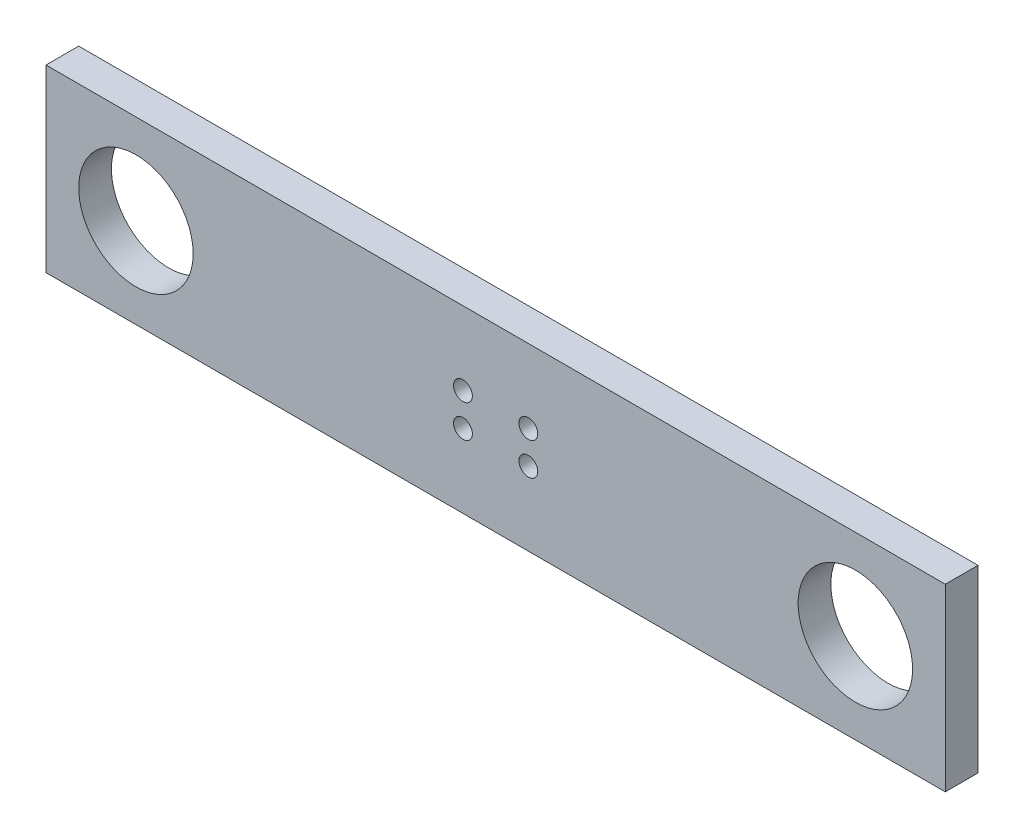
ISO-10303-21;
HEADER;
FILE_DESCRIPTION(('STEP AP214'),'2;1');
FILE_NAME('part.step','',(''),(''),'','','');
FILE_SCHEMA(('AUTOMOTIVE_DESIGN { 1 0 10303 214 1 1 1 1 }'));
ENDSEC;
DATA;
#1=APPLICATION_CONTEXT('core data for automotive mechanical design processes');
#2=APPLICATION_PROTOCOL_DEFINITION('international standard','automotive_design',2000,#1);
#3=PRODUCT_CONTEXT('',#1,'mechanical');
#4=PRODUCT('Part','Part','',(#3));
#5=PRODUCT_RELATED_PRODUCT_CATEGORY('part','',(#4));
#6=PRODUCT_DEFINITION_FORMATION('','',#4);
#7=PRODUCT_DEFINITION_CONTEXT('part definition',#1,'design');
#8=PRODUCT_DEFINITION('design','',#6,#7);
#9=PRODUCT_DEFINITION_SHAPE('','',#8);
#10=(LENGTH_UNIT() NAMED_UNIT(*) SI_UNIT(.MILLI.,.METRE.));
#11=(NAMED_UNIT(*) PLANE_ANGLE_UNIT() SI_UNIT($,.RADIAN.));
#12=(NAMED_UNIT(*) SI_UNIT($,.STERADIAN.) SOLID_ANGLE_UNIT());
#13=UNCERTAINTY_MEASURE_WITH_UNIT(LENGTH_MEASURE(1.E-05),#10,'distance_accuracy_value','');
#14=(GEOMETRIC_REPRESENTATION_CONTEXT(3) GLOBAL_UNCERTAINTY_ASSIGNED_CONTEXT((#13)) GLOBAL_UNIT_ASSIGNED_CONTEXT((#10,
#11,#12)) REPRESENTATION_CONTEXT('',''));
#15=CARTESIAN_POINT('',(0.,0.,0.));
#16=DIRECTION('',(0.,0.,1.));
#17=DIRECTION('',(1.,0.,0.));
#18=AXIS2_PLACEMENT_3D('',#15,#16,#17);
#19=CARTESIAN_POINT('',(0.,0.,6.35));
#20=DIRECTION('',(0.,0.,1.));
#21=DIRECTION('',(1.,0.,0.));
#22=AXIS2_PLACEMENT_3D('',#19,#20,#21);
#23=PLANE('',#22);
#24=CARTESIAN_POINT('',(-6.35,-3.175,6.35));
#25=DIRECTION('',(0.,0.,1.));
#26=DIRECTION('',(1.,0.,0.));
#27=AXIS2_PLACEMENT_3D('',#24,#25,#26);
#28=CIRCLE('',#27,1.8288);
#29=CARTESIAN_POINT('',(-4.5212,-3.175,6.35));
#30=VERTEX_POINT('',#29);
#31=EDGE_CURVE('E133',#30,#30,#28,.T.);
#32=ORIENTED_EDGE('',*,*,#31,.F.);
#33=EDGE_LOOP('',(#32));
#34=FACE_BOUND('',#33,.T.);
#35=CARTESIAN_POINT('',(-6.35,3.175,6.35));
#36=DIRECTION('',(0.,0.,1.));
#37=DIRECTION('',(1.,0.,0.));
#38=AXIS2_PLACEMENT_3D('',#35,#36,#37);
#39=CIRCLE('',#38,1.8288);
#40=CARTESIAN_POINT('',(-4.5212,3.175,6.35));
#41=VERTEX_POINT('',#40);
#42=EDGE_CURVE('E121',#41,#41,#39,.T.);
#43=ORIENTED_EDGE('',*,*,#42,.F.);
#44=EDGE_LOOP('',(#43));
#45=FACE_BOUND('',#44,.T.);
#46=CARTESIAN_POINT('',(-69.85,0.,6.35));
#47=DIRECTION('',(0.,0.,1.));
#48=DIRECTION('',(1.,0.,0.));
#49=AXIS2_PLACEMENT_3D('',#46,#47,#48);
#50=CIRCLE('',#49,11.1125);
#51=CARTESIAN_POINT('',(-58.7375,0.,6.35));
#52=VERTEX_POINT('',#51);
#53=EDGE_CURVE('E100',#52,#52,#50,.T.);
#54=ORIENTED_EDGE('',*,*,#53,.F.);
#55=EDGE_LOOP('',(#54));
#56=FACE_BOUND('',#55,.T.);
#57=DIRECTION('',(0.,-1.,0.));
#58=VECTOR('',#57,1.);
#59=CARTESIAN_POINT('',(-87.3125,17.4625,6.35));
#60=LINE('',#59,#58);
#61=CARTESIAN_POINT('',(-87.3125,17.4625,6.35));
#62=VERTEX_POINT('',#61);
#63=CARTESIAN_POINT('',(-87.3125,-17.4625,6.35));
#64=VERTEX_POINT('',#63);
#65=EDGE_CURVE('E85',#62,#64,#60,.T.);
#66=ORIENTED_EDGE('',*,*,#65,.T.);
#67=DIRECTION('',(1.,0.,0.));
#68=VECTOR('',#67,1.);
#69=CARTESIAN_POINT('',(-87.3125,-17.4625,6.35));
#70=LINE('',#69,#68);
#71=CARTESIAN_POINT('',(87.3125,-17.4625,6.35));
#72=VERTEX_POINT('',#71);
#73=EDGE_CURVE('E80',#64,#72,#70,.T.);
#74=ORIENTED_EDGE('',*,*,#73,.T.);
#75=DIRECTION('',(0.,1.,0.));
#76=VECTOR('',#75,1.);
#77=CARTESIAN_POINT('',(87.3125,17.4625,6.35));
#78=LINE('',#77,#76);
#79=CARTESIAN_POINT('',(87.3125,17.4625,6.35));
#80=VERTEX_POINT('',#79);
#81=EDGE_CURVE('E83',#72,#80,#78,.T.);
#82=ORIENTED_EDGE('',*,*,#81,.T.);
#83=DIRECTION('',(-1.,0.,0.));
#84=VECTOR('',#83,1.);
#85=CARTESIAN_POINT('',(-87.3125,17.4625,6.35));
#86=LINE('',#85,#84);
#87=EDGE_CURVE('E50',#80,#62,#86,.T.);
#88=ORIENTED_EDGE('',*,*,#87,.T.);
#89=EDGE_LOOP('',(#66,#74,#82,#88));
#90=FACE_BOUND('',#89,.T.);
#91=CARTESIAN_POINT('',(69.85,0.,6.35));
#92=DIRECTION('',(0.,0.,1.));
#93=DIRECTION('',(1.,0.,0.));
#94=AXIS2_PLACEMENT_3D('',#91,#92,#93);
#95=CIRCLE('',#94,11.1125);
#96=CARTESIAN_POINT('',(80.9625,0.,6.35));
#97=VERTEX_POINT('',#96);
#98=EDGE_CURVE('E115',#97,#97,#95,.T.);
#99=ORIENTED_EDGE('',*,*,#98,.F.);
#100=EDGE_LOOP('',(#99));
#101=FACE_BOUND('',#100,.T.);
#102=CARTESIAN_POINT('',(6.35,3.175,6.35));
#103=DIRECTION('',(0.,0.,1.));
#104=DIRECTION('',(1.,0.,0.));
#105=AXIS2_PLACEMENT_3D('',#102,#103,#104);
#106=CIRCLE('',#105,1.8288);
#107=CARTESIAN_POINT('',(8.1788,3.175,6.35));
#108=VERTEX_POINT('',#107);
#109=EDGE_CURVE('E127',#108,#108,#106,.T.);
#110=ORIENTED_EDGE('',*,*,#109,.F.);
#111=EDGE_LOOP('',(#110));
#112=FACE_BOUND('',#111,.T.);
#113=CARTESIAN_POINT('',(6.35,-3.175,6.35));
#114=DIRECTION('',(0.,0.,1.));
#115=DIRECTION('',(1.,0.,0.));
#116=AXIS2_PLACEMENT_3D('',#113,#114,#115);
#117=CIRCLE('',#116,1.8288);
#118=CARTESIAN_POINT('',(8.1788,-3.175,6.35));
#119=VERTEX_POINT('',#118);
#120=EDGE_CURVE('E139',#119,#119,#117,.T.);
#121=ORIENTED_EDGE('',*,*,#120,.F.);
#122=EDGE_LOOP('',(#121));
#123=FACE_BOUND('',#122,.T.);
#124=ADVANCED_FACE('F33',(#34,#45,#56,#90,#101,#112,#123),#23,.T.);
#125=CARTESIAN_POINT('',(0.,0.,0.));
#126=DIRECTION('',(0.,0.,1.));
#127=DIRECTION('',(1.,0.,0.));
#128=AXIS2_PLACEMENT_3D('',#125,#126,#127);
#129=PLANE('',#128);
#130=DIRECTION('',(0.,-1.,0.));
#131=VECTOR('',#130,1.);
#132=CARTESIAN_POINT('',(-87.3125,17.4625,0.));
#133=LINE('',#132,#131);
#134=CARTESIAN_POINT('',(-87.3125,17.4625,0.));
#135=VERTEX_POINT('',#134);
#136=CARTESIAN_POINT('',(-87.3125,-17.4625,0.));
#137=VERTEX_POINT('',#136);
#138=EDGE_CURVE('E97',#135,#137,#133,.T.);
#139=ORIENTED_EDGE('',*,*,#138,.F.);
#140=DIRECTION('',(-1.,0.,0.));
#141=VECTOR('',#140,1.);
#142=CARTESIAN_POINT('',(-87.3125,17.4625,0.));
#143=LINE('',#142,#141);
#144=CARTESIAN_POINT('',(87.3125,17.4625,0.));
#145=VERTEX_POINT('',#144);
#146=EDGE_CURVE('E73',#145,#135,#143,.T.);
#147=ORIENTED_EDGE('',*,*,#146,.F.);
#148=DIRECTION('',(0.,1.,0.));
#149=VECTOR('',#148,1.);
#150=CARTESIAN_POINT('',(87.3125,17.4625,0.));
#151=LINE('',#150,#149);
#152=CARTESIAN_POINT('',(87.3125,-17.4625,0.));
#153=VERTEX_POINT('',#152);
#154=EDGE_CURVE('E67',#153,#145,#151,.T.);
#155=ORIENTED_EDGE('',*,*,#154,.F.);
#156=DIRECTION('',(1.,0.,0.));
#157=VECTOR('',#156,1.);
#158=CARTESIAN_POINT('',(-87.3125,-17.4625,0.));
#159=LINE('',#158,#157);
#160=EDGE_CURVE('E89',#137,#153,#159,.T.);
#161=ORIENTED_EDGE('',*,*,#160,.F.);
#162=EDGE_LOOP('',(#139,#147,#155,#161));
#163=FACE_BOUND('',#162,.T.);
#164=CARTESIAN_POINT('',(-69.85,0.,0.));
#165=DIRECTION('',(0.,0.,1.));
#166=DIRECTION('',(1.,0.,0.));
#167=AXIS2_PLACEMENT_3D('',#164,#165,#166);
#168=CIRCLE('',#167,11.1125);
#169=CARTESIAN_POINT('',(-58.7375,0.,0.));
#170=VERTEX_POINT('',#169);
#171=EDGE_CURVE('E112',#170,#170,#168,.T.);
#172=ORIENTED_EDGE('',*,*,#171,.T.);
#173=EDGE_LOOP('',(#172));
#174=FACE_BOUND('',#173,.T.);
#175=CARTESIAN_POINT('',(69.85,0.,0.));
#176=DIRECTION('',(0.,0.,1.));
#177=DIRECTION('',(1.,0.,0.));
#178=AXIS2_PLACEMENT_3D('',#175,#176,#177);
#179=CIRCLE('',#178,11.1125);
#180=CARTESIAN_POINT('',(80.9625,0.,0.));
#181=VERTEX_POINT('',#180);
#182=EDGE_CURVE('E118',#181,#181,#179,.T.);
#183=ORIENTED_EDGE('',*,*,#182,.T.);
#184=EDGE_LOOP('',(#183));
#185=FACE_BOUND('',#184,.T.);
#186=CARTESIAN_POINT('',(-6.35,3.175,0.));
#187=DIRECTION('',(0.,0.,1.));
#188=DIRECTION('',(1.,0.,0.));
#189=AXIS2_PLACEMENT_3D('',#186,#187,#188);
#190=CIRCLE('',#189,1.8288);
#191=CARTESIAN_POINT('',(-4.5212,3.175,0.));
#192=VERTEX_POINT('',#191);
#193=EDGE_CURVE('E124',#192,#192,#190,.T.);
#194=ORIENTED_EDGE('',*,*,#193,.T.);
#195=EDGE_LOOP('',(#194));
#196=FACE_BOUND('',#195,.T.);
#197=CARTESIAN_POINT('',(6.35,3.175,0.));
#198=DIRECTION('',(0.,0.,1.));
#199=DIRECTION('',(1.,0.,0.));
#200=AXIS2_PLACEMENT_3D('',#197,#198,#199);
#201=CIRCLE('',#200,1.8288);
#202=CARTESIAN_POINT('',(8.1788,3.175,0.));
#203=VERTEX_POINT('',#202);
#204=EDGE_CURVE('E130',#203,#203,#201,.T.);
#205=ORIENTED_EDGE('',*,*,#204,.T.);
#206=EDGE_LOOP('',(#205));
#207=FACE_BOUND('',#206,.T.);
#208=CARTESIAN_POINT('',(-6.35,-3.175,0.));
#209=DIRECTION('',(0.,0.,1.));
#210=DIRECTION('',(1.,0.,0.));
#211=AXIS2_PLACEMENT_3D('',#208,#209,#210);
#212=CIRCLE('',#211,1.8288);
#213=CARTESIAN_POINT('',(-4.5212,-3.175,0.));
#214=VERTEX_POINT('',#213);
#215=EDGE_CURVE('E136',#214,#214,#212,.T.);
#216=ORIENTED_EDGE('',*,*,#215,.T.);
#217=EDGE_LOOP('',(#216));
#218=FACE_BOUND('',#217,.T.);
#219=CARTESIAN_POINT('',(6.35,-3.175,0.));
#220=DIRECTION('',(0.,0.,1.));
#221=DIRECTION('',(1.,0.,0.));
#222=AXIS2_PLACEMENT_3D('',#219,#220,#221);
#223=CIRCLE('',#222,1.8288);
#224=CARTESIAN_POINT('',(8.1788,-3.175,0.));
#225=VERTEX_POINT('',#224);
#226=EDGE_CURVE('E142',#225,#225,#223,.T.);
#227=ORIENTED_EDGE('',*,*,#226,.T.);
#228=EDGE_LOOP('',(#227));
#229=FACE_BOUND('',#228,.T.);
#230=ADVANCED_FACE('F108',(#163,#174,#185,#196,#207,#218,#229),#129,.F.);
#231=CARTESIAN_POINT('',(-87.3125,17.4625,6.35));
#232=DIRECTION('',(1.,0.,0.));
#233=DIRECTION('',(0.,0.,-1.));
#234=AXIS2_PLACEMENT_3D('',#231,#232,#233);
#235=PLANE('',#234);
#236=ORIENTED_EDGE('',*,*,#138,.T.);
#237=DIRECTION('',(0.,0.,-1.));
#238=VECTOR('',#237,1.);
#239=CARTESIAN_POINT('',(-87.3125,-17.4625,6.35));
#240=LINE('',#239,#238);
#241=EDGE_CURVE('E11',#64,#137,#240,.T.);
#242=ORIENTED_EDGE('',*,*,#241,.F.);
#243=ORIENTED_EDGE('',*,*,#65,.F.);
#244=DIRECTION('',(0.,0.,-1.));
#245=VECTOR('',#244,1.);
#246=CARTESIAN_POINT('',(-87.3125,17.4625,6.35));
#247=LINE('',#246,#245);
#248=EDGE_CURVE('E93',#62,#135,#247,.T.);
#249=ORIENTED_EDGE('',*,*,#248,.T.);
#250=EDGE_LOOP('',(#236,#242,#243,#249));
#251=FACE_BOUND('',#250,.T.);
#252=ADVANCED_FACE('F35',(#251),#235,.F.);
#253=CARTESIAN_POINT('',(-87.3125,-17.4625,6.35));
#254=DIRECTION('',(0.,1.,0.));
#255=DIRECTION('',(0.,0.,1.));
#256=AXIS2_PLACEMENT_3D('',#253,#254,#255);
#257=PLANE('',#256);
#258=ORIENTED_EDGE('',*,*,#160,.T.);
#259=DIRECTION('',(0.,0.,-1.));
#260=VECTOR('',#259,1.);
#261=CARTESIAN_POINT('',(87.3125,-17.4625,6.35));
#262=LINE('',#261,#260);
#263=EDGE_CURVE('E42',#72,#153,#262,.T.);
#264=ORIENTED_EDGE('',*,*,#263,.F.);
#265=ORIENTED_EDGE('',*,*,#73,.F.);
#266=ORIENTED_EDGE('',*,*,#241,.T.);
#267=EDGE_LOOP('',(#258,#264,#265,#266));
#268=FACE_BOUND('',#267,.T.);
#269=ADVANCED_FACE('F88',(#268),#257,.F.);
#270=CARTESIAN_POINT('',(87.3125,17.4625,6.35));
#271=DIRECTION('',(-1.,0.,0.));
#272=DIRECTION('',(0.,0.,1.));
#273=AXIS2_PLACEMENT_3D('',#270,#271,#272);
#274=PLANE('',#273);
#275=ORIENTED_EDGE('',*,*,#154,.T.);
#276=DIRECTION('',(0.,0.,-1.));
#277=VECTOR('',#276,1.);
#278=CARTESIAN_POINT('',(87.3125,17.4625,6.35));
#279=LINE('',#278,#277);
#280=EDGE_CURVE('E90',#80,#145,#279,.T.);
#281=ORIENTED_EDGE('',*,*,#280,.F.);
#282=ORIENTED_EDGE('',*,*,#81,.F.);
#283=ORIENTED_EDGE('',*,*,#263,.T.);
#284=EDGE_LOOP('',(#275,#281,#282,#283));
#285=FACE_BOUND('',#284,.T.);
#286=ADVANCED_FACE('F91',(#285),#274,.F.);
#287=CARTESIAN_POINT('',(-87.3125,17.4625,6.35));
#288=DIRECTION('',(0.,-1.,0.));
#289=DIRECTION('',(0.,0.,-1.));
#290=AXIS2_PLACEMENT_3D('',#287,#288,#289);
#291=PLANE('',#290);
#292=ORIENTED_EDGE('',*,*,#146,.T.);
#293=ORIENTED_EDGE('',*,*,#248,.F.);
#294=ORIENTED_EDGE('',*,*,#87,.F.);
#295=ORIENTED_EDGE('',*,*,#280,.T.);
#296=EDGE_LOOP('',(#292,#293,#294,#295));
#297=FACE_BOUND('',#296,.T.);
#298=ADVANCED_FACE('F105',(#297),#291,.F.);
#299=CARTESIAN_POINT('',(-69.85,0.,6.35));
#300=DIRECTION('',(0.,0.,-1.));
#301=DIRECTION('',(-1.,0.,0.));
#302=AXIS2_PLACEMENT_3D('',#299,#300,#301);
#303=CYLINDRICAL_SURFACE('',#302,11.1125);
#304=ORIENTED_EDGE('',*,*,#53,.T.);
#305=EDGE_LOOP('',(#304));
#306=FACE_BOUND('',#305,.T.);
#307=ORIENTED_EDGE('',*,*,#171,.F.);
#308=EDGE_LOOP('',(#307));
#309=FACE_BOUND('',#308,.T.);
#310=ADVANCED_FACE('F161',(#306,#309),#303,.F.);
#311=CARTESIAN_POINT('',(69.85,0.,6.35));
#312=DIRECTION('',(0.,0.,-1.));
#313=DIRECTION('',(-1.,0.,0.));
#314=AXIS2_PLACEMENT_3D('',#311,#312,#313);
#315=CYLINDRICAL_SURFACE('',#314,11.1125);
#316=ORIENTED_EDGE('',*,*,#98,.T.);
#317=EDGE_LOOP('',(#316));
#318=FACE_BOUND('',#317,.T.);
#319=ORIENTED_EDGE('',*,*,#182,.F.);
#320=EDGE_LOOP('',(#319));
#321=FACE_BOUND('',#320,.T.);
#322=ADVANCED_FACE('F207',(#318,#321),#315,.F.);
#323=CARTESIAN_POINT('',(-6.35,3.175,6.35));
#324=DIRECTION('',(0.,0.,-1.));
#325=DIRECTION('',(-1.,0.,0.));
#326=AXIS2_PLACEMENT_3D('',#323,#324,#325);
#327=CYLINDRICAL_SURFACE('',#326,1.8288);
#328=ORIENTED_EDGE('',*,*,#42,.T.);
#329=EDGE_LOOP('',(#328));
#330=FACE_BOUND('',#329,.T.);
#331=ORIENTED_EDGE('',*,*,#193,.F.);
#332=EDGE_LOOP('',(#331));
#333=FACE_BOUND('',#332,.T.);
#334=ADVANCED_FACE('F215',(#330,#333),#327,.F.);
#335=CARTESIAN_POINT('',(6.35,3.175,6.35));
#336=DIRECTION('',(0.,0.,-1.));
#337=DIRECTION('',(-1.,0.,0.));
#338=AXIS2_PLACEMENT_3D('',#335,#336,#337);
#339=CYLINDRICAL_SURFACE('',#338,1.8288);
#340=ORIENTED_EDGE('',*,*,#109,.T.);
#341=EDGE_LOOP('',(#340));
#342=FACE_BOUND('',#341,.T.);
#343=ORIENTED_EDGE('',*,*,#204,.F.);
#344=EDGE_LOOP('',(#343));
#345=FACE_BOUND('',#344,.T.);
#346=ADVANCED_FACE('F223',(#342,#345),#339,.F.);
#347=CARTESIAN_POINT('',(-6.35,-3.175,6.35));
#348=DIRECTION('',(0.,0.,-1.));
#349=DIRECTION('',(-1.,0.,0.));
#350=AXIS2_PLACEMENT_3D('',#347,#348,#349);
#351=CYLINDRICAL_SURFACE('',#350,1.8288);
#352=ORIENTED_EDGE('',*,*,#31,.T.);
#353=EDGE_LOOP('',(#352));
#354=FACE_BOUND('',#353,.T.);
#355=ORIENTED_EDGE('',*,*,#215,.F.);
#356=EDGE_LOOP('',(#355));
#357=FACE_BOUND('',#356,.T.);
#358=ADVANCED_FACE('F232',(#354,#357),#351,.F.);
#359=CARTESIAN_POINT('',(6.35,-3.175,6.35));
#360=DIRECTION('',(0.,0.,-1.));
#361=DIRECTION('',(-1.,0.,0.));
#362=AXIS2_PLACEMENT_3D('',#359,#360,#361);
#363=CYLINDRICAL_SURFACE('',#362,1.8288);
#364=ORIENTED_EDGE('',*,*,#120,.T.);
#365=EDGE_LOOP('',(#364));
#366=FACE_BOUND('',#365,.T.);
#367=ORIENTED_EDGE('',*,*,#226,.F.);
#368=EDGE_LOOP('',(#367));
#369=FACE_BOUND('',#368,.T.);
#370=ADVANCED_FACE('F148',(#366,#369),#363,.F.);
#371=CLOSED_SHELL('',(#124,#230,#252,#269,#286,#298,#310,#322,#334,#346,#358,#370));
#372=MANIFOLD_SOLID_BREP('B2',#371);
#373=ADVANCED_BREP_SHAPE_REPRESENTATION('',(#18,#372),#14);
#374=SHAPE_DEFINITION_REPRESENTATION(#9,#373);
ENDSEC;
END-ISO-10303-21;
